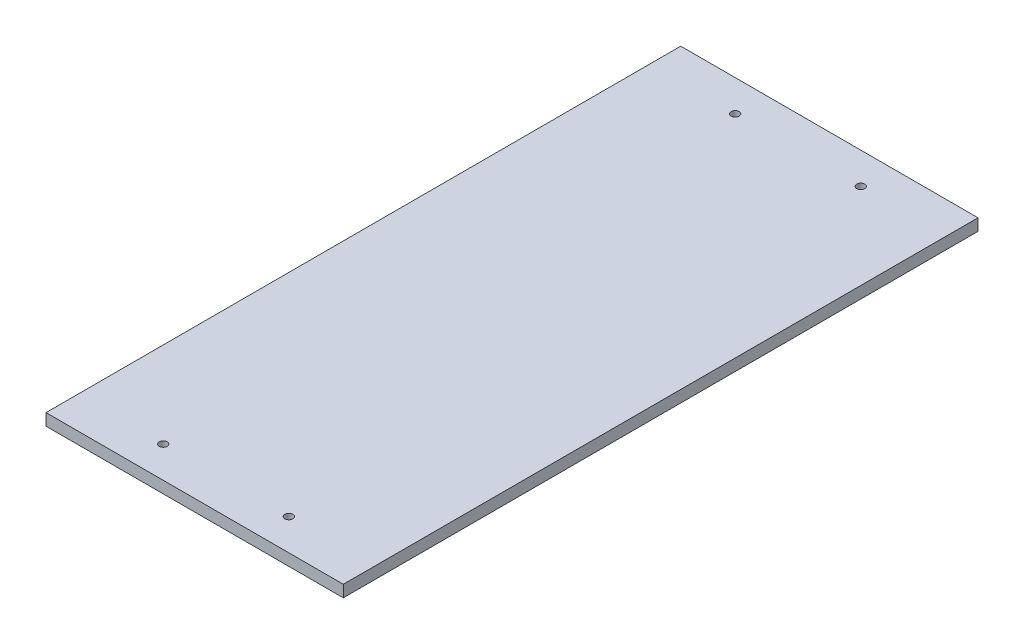
ISO-10303-21;
HEADER;
FILE_DESCRIPTION(('STEP AP214'),'2;1');
FILE_NAME('part.step','',(''),(''),'','','');
FILE_SCHEMA(('AUTOMOTIVE_DESIGN { 1 0 10303 214 1 1 1 1 }'));
ENDSEC;
DATA;
#1=APPLICATION_CONTEXT('core data for automotive mechanical design processes');
#2=APPLICATION_PROTOCOL_DEFINITION('international standard','automotive_design',2000,#1);
#3=PRODUCT_CONTEXT('',#1,'mechanical');
#4=PRODUCT('Part','Part','',(#3));
#5=PRODUCT_RELATED_PRODUCT_CATEGORY('part','',(#4));
#6=PRODUCT_DEFINITION_FORMATION('','',#4);
#7=PRODUCT_DEFINITION_CONTEXT('part definition',#1,'design');
#8=PRODUCT_DEFINITION('design','',#6,#7);
#9=PRODUCT_DEFINITION_SHAPE('','',#8);
#10=(LENGTH_UNIT() NAMED_UNIT(*) SI_UNIT(.MILLI.,.METRE.));
#11=(NAMED_UNIT(*) PLANE_ANGLE_UNIT() SI_UNIT($,.RADIAN.));
#12=(NAMED_UNIT(*) SI_UNIT($,.STERADIAN.) SOLID_ANGLE_UNIT());
#13=UNCERTAINTY_MEASURE_WITH_UNIT(LENGTH_MEASURE(1.E-05),#10,'distance_accuracy_value','');
#14=(GEOMETRIC_REPRESENTATION_CONTEXT(3) GLOBAL_UNCERTAINTY_ASSIGNED_CONTEXT((#13)) GLOBAL_UNIT_ASSIGNED_CONTEXT((#10,
#11,#12)) REPRESENTATION_CONTEXT('',''));
#15=CARTESIAN_POINT('',(0.,0.,0.));
#16=DIRECTION('',(0.,0.,1.));
#17=DIRECTION('',(1.,0.,0.));
#18=AXIS2_PLACEMENT_3D('',#15,#16,#17);
#19=CARTESIAN_POINT('',(-152.4,-9.525,304.8));
#20=DIRECTION('',(0.,0.,1.));
#21=DIRECTION('',(1.,0.,0.));
#22=AXIS2_PLACEMENT_3D('',#19,#20,#21);
#23=PLANE('',#22);
#24=DIRECTION('',(0.,1.,0.));
#25=VECTOR('',#24,1.);
#26=CARTESIAN_POINT('',(120.245,-15.24,304.8));
#27=LINE('',#26,#25);
#28=CARTESIAN_POINT('',(120.245,-9.525,304.8));
#29=VERTEX_POINT('',#28);
#30=CARTESIAN_POINT('',(120.245,0.,304.8));
#31=VERTEX_POINT('',#30);
#32=EDGE_CURVE('E61',#29,#31,#27,.T.);
#33=ORIENTED_EDGE('',*,*,#32,.T.);
#34=DIRECTION('',(1.,0.,0.));
#35=VECTOR('',#34,1.);
#36=CARTESIAN_POINT('',(-152.4,0.,304.8));
#37=LINE('',#36,#35);
#38=CARTESIAN_POINT('',(-120.245,0.,304.8));
#39=VERTEX_POINT('',#38);
#40=EDGE_CURVE('E42',#39,#31,#37,.T.);
#41=ORIENTED_EDGE('',*,*,#40,.F.);
#42=DIRECTION('',(0.,1.,0.));
#43=VECTOR('',#42,1.);
#44=CARTESIAN_POINT('',(-120.245,-15.24,304.8));
#45=LINE('',#44,#43);
#46=CARTESIAN_POINT('',(-120.245,-9.525,304.8));
#47=VERTEX_POINT('',#46);
#48=EDGE_CURVE('E53',#47,#39,#45,.T.);
#49=ORIENTED_EDGE('',*,*,#48,.F.);
#50=DIRECTION('',(1.,0.,0.));
#51=VECTOR('',#50,1.);
#52=CARTESIAN_POINT('',(-152.4,-9.525,304.8));
#53=LINE('',#52,#51);
#54=EDGE_CURVE('E11',#47,#29,#53,.T.);
#55=ORIENTED_EDGE('',*,*,#54,.T.);
#56=EDGE_LOOP('',(#33,#41,#49,#55));
#57=FACE_BOUND('',#56,.T.);
#58=ADVANCED_FACE('F39',(#57),#23,.T.);
#59=CARTESIAN_POINT('',(0.,-9.525,0.));
#60=DIRECTION('',(0.,1.,0.));
#61=DIRECTION('',(0.,0.,1.));
#62=AXIS2_PLACEMENT_3D('',#59,#60,#61);
#63=PLANE('',#62);
#64=CARTESIAN_POINT('',(50.8,-9.525,279.4));
#65=DIRECTION('',(0.,-1.,0.));
#66=DIRECTION('',(0.,0.,1.));
#67=AXIS2_PLACEMENT_3D('',#64,#65,#66);
#68=CIRCLE('',#67,3.2258);
#69=CARTESIAN_POINT('',(50.8,-9.525,282.6258));
#70=VERTEX_POINT('',#69);
#71=EDGE_CURVE('E119',#70,#70,#68,.T.);
#72=ORIENTED_EDGE('',*,*,#71,.F.);
#73=EDGE_LOOP('',(#72));
#74=FACE_BOUND('',#73,.T.);
#75=CARTESIAN_POINT('',(-50.8,-9.525,279.4));
#76=DIRECTION('',(0.,-1.,0.));
#77=DIRECTION('',(0.,0.,-1.));
#78=AXIS2_PLACEMENT_3D('',#75,#76,#77);
#79=CIRCLE('',#78,3.2258);
#80=CARTESIAN_POINT('',(-50.8,-9.525,276.1742));
#81=VERTEX_POINT('',#80);
#82=EDGE_CURVE('E125',#81,#81,#79,.T.);
#83=ORIENTED_EDGE('',*,*,#82,.F.);
#84=EDGE_LOOP('',(#83));
#85=FACE_BOUND('',#84,.T.);
#86=CARTESIAN_POINT('',(-50.8,-9.525,-183.261));
#87=DIRECTION('',(0.,-1.,0.));
#88=DIRECTION('',(0.,0.,1.));
#89=AXIS2_PLACEMENT_3D('',#86,#87,#88);
#90=CIRCLE('',#89,3.2258);
#91=CARTESIAN_POINT('',(-50.8,-9.525,-180.0352));
#92=VERTEX_POINT('',#91);
#93=EDGE_CURVE('E113',#92,#92,#90,.T.);
#94=ORIENTED_EDGE('',*,*,#93,.F.);
#95=EDGE_LOOP('',(#94));
#96=FACE_BOUND('',#95,.T.);
#97=CARTESIAN_POINT('',(50.8,-9.525,-183.261));
#98=DIRECTION('',(0.,-1.,0.));
#99=DIRECTION('',(0.,0.,-1.));
#100=AXIS2_PLACEMENT_3D('',#97,#98,#99);
#101=CIRCLE('',#100,3.2258);
#102=CARTESIAN_POINT('',(50.8,-9.525,-186.4868));
#103=VERTEX_POINT('',#102);
#104=EDGE_CURVE('E110',#103,#103,#101,.T.);
#105=ORIENTED_EDGE('',*,*,#104,.F.);
#106=EDGE_LOOP('',(#105));
#107=FACE_BOUND('',#106,.T.);
#108=DIRECTION('',(1.,0.,0.));
#109=VECTOR('',#108,1.);
#110=CARTESIAN_POINT('',(0.,-9.525,-208.661));
#111=LINE('',#110,#109);
#112=CARTESIAN_POINT('',(-120.245,-9.525,-208.661));
#113=VERTEX_POINT('',#112);
#114=CARTESIAN_POINT('',(120.245,-9.525,-208.661));
#115=VERTEX_POINT('',#114);
#116=EDGE_CURVE('E97',#113,#115,#111,.T.);
#117=ORIENTED_EDGE('',*,*,#116,.T.);
#118=DIRECTION('',(0.,0.,1.));
#119=VECTOR('',#118,1.);
#120=CARTESIAN_POINT('',(120.245,-9.525,0.));
#121=LINE('',#120,#119);
#122=EDGE_CURVE('E96',#115,#29,#121,.T.);
#123=ORIENTED_EDGE('',*,*,#122,.T.);
#124=ORIENTED_EDGE('',*,*,#54,.F.);
#125=DIRECTION('',(0.,0.,1.));
#126=VECTOR('',#125,1.);
#127=CARTESIAN_POINT('',(-120.245,-9.525,0.));
#128=LINE('',#127,#126);
#129=EDGE_CURVE('E92',#113,#47,#128,.T.);
#130=ORIENTED_EDGE('',*,*,#129,.F.);
#131=EDGE_LOOP('',(#117,#123,#124,#130));
#132=FACE_BOUND('',#131,.T.);
#133=ADVANCED_FACE('F136',(#74,#85,#96,#107,#132),#63,.F.);
#134=CARTESIAN_POINT('',(0.,0.,0.));
#135=DIRECTION('',(0.,1.,0.));
#136=DIRECTION('',(0.,0.,1.));
#137=AXIS2_PLACEMENT_3D('',#134,#135,#136);
#138=PLANE('',#137);
#139=CARTESIAN_POINT('',(50.8,0.,279.4));
#140=DIRECTION('',(0.,-1.,0.));
#141=DIRECTION('',(0.,0.,1.));
#142=AXIS2_PLACEMENT_3D('',#139,#140,#141);
#143=CIRCLE('',#142,3.2258);
#144=CARTESIAN_POINT('',(50.8,0.,282.6258));
#145=VERTEX_POINT('',#144);
#146=EDGE_CURVE('E116',#145,#145,#143,.T.);
#147=ORIENTED_EDGE('',*,*,#146,.T.);
#148=EDGE_LOOP('',(#147));
#149=FACE_BOUND('',#148,.T.);
#150=CARTESIAN_POINT('',(-50.8,0.,279.4));
#151=DIRECTION('',(0.,-1.,0.));
#152=DIRECTION('',(0.,0.,-1.));
#153=AXIS2_PLACEMENT_3D('',#150,#151,#152);
#154=CIRCLE('',#153,3.2258);
#155=CARTESIAN_POINT('',(-50.8,0.,276.1742));
#156=VERTEX_POINT('',#155);
#157=EDGE_CURVE('E122',#156,#156,#154,.T.);
#158=ORIENTED_EDGE('',*,*,#157,.T.);
#159=EDGE_LOOP('',(#158));
#160=FACE_BOUND('',#159,.T.);
#161=CARTESIAN_POINT('',(-50.8,0.,-183.261));
#162=DIRECTION('',(0.,-1.,0.));
#163=DIRECTION('',(0.,0.,1.));
#164=AXIS2_PLACEMENT_3D('',#161,#162,#163);
#165=CIRCLE('',#164,3.2258);
#166=CARTESIAN_POINT('',(-50.8,0.,-180.0352));
#167=VERTEX_POINT('',#166);
#168=EDGE_CURVE('E128',#167,#167,#165,.T.);
#169=ORIENTED_EDGE('',*,*,#168,.T.);
#170=EDGE_LOOP('',(#169));
#171=FACE_BOUND('',#170,.T.);
#172=CARTESIAN_POINT('',(50.8,0.,-183.261));
#173=DIRECTION('',(0.,-1.,0.));
#174=DIRECTION('',(0.,0.,-1.));
#175=AXIS2_PLACEMENT_3D('',#172,#173,#174);
#176=CIRCLE('',#175,3.2258);
#177=CARTESIAN_POINT('',(50.8,0.,-186.4868));
#178=VERTEX_POINT('',#177);
#179=EDGE_CURVE('E87',#178,#178,#176,.T.);
#180=ORIENTED_EDGE('',*,*,#179,.T.);
#181=EDGE_LOOP('',(#180));
#182=FACE_BOUND('',#181,.T.);
#183=DIRECTION('',(0.,0.,1.));
#184=VECTOR('',#183,1.);
#185=CARTESIAN_POINT('',(120.245,0.,-208.661));
#186=LINE('',#185,#184);
#187=CARTESIAN_POINT('',(120.245,0.,-208.661));
#188=VERTEX_POINT('',#187);
#189=EDGE_CURVE('E78',#188,#31,#186,.T.);
#190=ORIENTED_EDGE('',*,*,#189,.F.);
#191=DIRECTION('',(1.,0.,0.));
#192=VECTOR('',#191,1.);
#193=CARTESIAN_POINT('',(-120.245,0.,-208.661));
#194=LINE('',#193,#192);
#195=CARTESIAN_POINT('',(-120.245,0.,-208.661));
#196=VERTEX_POINT('',#195);
#197=EDGE_CURVE('E86',#196,#188,#194,.T.);
#198=ORIENTED_EDGE('',*,*,#197,.F.);
#199=DIRECTION('',(0.,0.,1.));
#200=VECTOR('',#199,1.);
#201=CARTESIAN_POINT('',(-120.245,0.,-208.661));
#202=LINE('',#201,#200);
#203=EDGE_CURVE('E95',#196,#39,#202,.T.);
#204=ORIENTED_EDGE('',*,*,#203,.T.);
#205=ORIENTED_EDGE('',*,*,#40,.T.);
#206=EDGE_LOOP('',(#190,#198,#204,#205));
#207=FACE_BOUND('',#206,.T.);
#208=ADVANCED_FACE('F94',(#149,#160,#171,#182,#207),#138,.T.);
#209=CARTESIAN_POINT('',(120.245,-15.24,-208.661));
#210=DIRECTION('',(-1.,0.,0.));
#211=DIRECTION('',(0.,0.,1.));
#212=AXIS2_PLACEMENT_3D('',#209,#210,#211);
#213=PLANE('',#212);
#214=DIRECTION('',(0.,1.,0.));
#215=VECTOR('',#214,1.);
#216=CARTESIAN_POINT('',(120.245,-15.24,-208.661));
#217=LINE('',#216,#215);
#218=EDGE_CURVE('E81',#115,#188,#217,.T.);
#219=ORIENTED_EDGE('',*,*,#218,.T.);
#220=ORIENTED_EDGE('',*,*,#189,.T.);
#221=ORIENTED_EDGE('',*,*,#32,.F.);
#222=ORIENTED_EDGE('',*,*,#122,.F.);
#223=EDGE_LOOP('',(#219,#220,#221,#222));
#224=FACE_BOUND('',#223,.T.);
#225=ADVANCED_FACE('F79',(#224),#213,.F.);
#226=CARTESIAN_POINT('',(-120.245,-15.24,-208.661));
#227=DIRECTION('',(0.,0.,1.));
#228=DIRECTION('',(1.,0.,0.));
#229=AXIS2_PLACEMENT_3D('',#226,#227,#228);
#230=PLANE('',#229);
#231=DIRECTION('',(0.,1.,0.));
#232=VECTOR('',#231,1.);
#233=CARTESIAN_POINT('',(-120.245,-15.24,-208.661));
#234=LINE('',#233,#232);
#235=EDGE_CURVE('E105',#113,#196,#234,.T.);
#236=ORIENTED_EDGE('',*,*,#235,.T.);
#237=ORIENTED_EDGE('',*,*,#197,.T.);
#238=ORIENTED_EDGE('',*,*,#218,.F.);
#239=ORIENTED_EDGE('',*,*,#116,.F.);
#240=EDGE_LOOP('',(#236,#237,#238,#239));
#241=FACE_BOUND('',#240,.T.);
#242=ADVANCED_FACE('F145',(#241),#230,.F.);
#243=CARTESIAN_POINT('',(-120.245,-15.24,-208.661));
#244=DIRECTION('',(-1.,0.,0.));
#245=DIRECTION('',(0.,0.,1.));
#246=AXIS2_PLACEMENT_3D('',#243,#244,#245);
#247=PLANE('',#246);
#248=ORIENTED_EDGE('',*,*,#129,.T.);
#249=ORIENTED_EDGE('',*,*,#48,.T.);
#250=ORIENTED_EDGE('',*,*,#203,.F.);
#251=ORIENTED_EDGE('',*,*,#235,.F.);
#252=EDGE_LOOP('',(#248,#249,#250,#251));
#253=FACE_BOUND('',#252,.T.);
#254=ADVANCED_FACE('F146',(#253),#247,.T.);
#255=CARTESIAN_POINT('',(50.8,0.,-183.261));
#256=DIRECTION('',(0.,-1.,0.));
#257=DIRECTION('',(0.,0.,-1.));
#258=AXIS2_PLACEMENT_3D('',#255,#256,#257);
#259=CYLINDRICAL_SURFACE('',#258,3.2258);
#260=ORIENTED_EDGE('',*,*,#179,.F.);
#261=EDGE_LOOP('',(#260));
#262=FACE_BOUND('',#261,.T.);
#263=ORIENTED_EDGE('',*,*,#104,.T.);
#264=EDGE_LOOP('',(#263));
#265=FACE_BOUND('',#264,.T.);
#266=ADVANCED_FACE('F148',(#262,#265),#259,.F.);
#267=CARTESIAN_POINT('',(-50.8,0.,-183.261));
#268=DIRECTION('',(0.,-1.,0.));
#269=DIRECTION('',(0.,0.,-1.));
#270=AXIS2_PLACEMENT_3D('',#267,#268,#269);
#271=CYLINDRICAL_SURFACE('',#270,3.2258);
#272=ORIENTED_EDGE('',*,*,#168,.F.);
#273=EDGE_LOOP('',(#272));
#274=FACE_BOUND('',#273,.T.);
#275=ORIENTED_EDGE('',*,*,#93,.T.);
#276=EDGE_LOOP('',(#275));
#277=FACE_BOUND('',#276,.T.);
#278=ADVANCED_FACE('F134',(#274,#277),#271,.F.);
#279=CARTESIAN_POINT('',(-50.8,0.,279.4));
#280=DIRECTION('',(0.,-1.,0.));
#281=DIRECTION('',(0.,0.,-1.));
#282=AXIS2_PLACEMENT_3D('',#279,#280,#281);
#283=CYLINDRICAL_SURFACE('',#282,3.2258);
#284=ORIENTED_EDGE('',*,*,#157,.F.);
#285=EDGE_LOOP('',(#284));
#286=FACE_BOUND('',#285,.T.);
#287=ORIENTED_EDGE('',*,*,#82,.T.);
#288=EDGE_LOOP('',(#287));
#289=FACE_BOUND('',#288,.T.);
#290=ADVANCED_FACE('F193',(#286,#289),#283,.F.);
#291=CARTESIAN_POINT('',(50.8,0.,279.4));
#292=DIRECTION('',(0.,-1.,0.));
#293=DIRECTION('',(0.,0.,-1.));
#294=AXIS2_PLACEMENT_3D('',#291,#292,#293);
#295=CYLINDRICAL_SURFACE('',#294,3.2258);
#296=ORIENTED_EDGE('',*,*,#146,.F.);
#297=EDGE_LOOP('',(#296));
#298=FACE_BOUND('',#297,.T.);
#299=ORIENTED_EDGE('',*,*,#71,.T.);
#300=EDGE_LOOP('',(#299));
#301=FACE_BOUND('',#300,.T.);
#302=ADVANCED_FACE('F203',(#298,#301),#295,.F.);
#303=CLOSED_SHELL('',(#58,#133,#208,#225,#242,#254,#266,#278,#290,#302));
#304=MANIFOLD_SOLID_BREP('B2',#303);
#305=ADVANCED_BREP_SHAPE_REPRESENTATION('',(#18,#304),#14);
#306=SHAPE_DEFINITION_REPRESENTATION(#9,#305);
ENDSEC;
END-ISO-10303-21;
